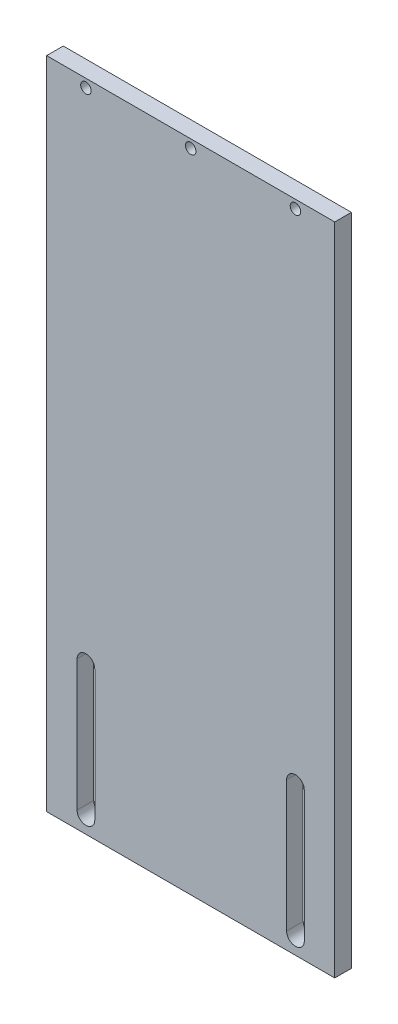
ISO-10303-21;
HEADER;
FILE_DESCRIPTION(('STEP AP214'),'2;1');
FILE_NAME('part.step','',(''),(''),'','','');
FILE_SCHEMA(('AUTOMOTIVE_DESIGN { 1 0 10303 214 1 1 1 1 }'));
ENDSEC;
DATA;
#1=APPLICATION_CONTEXT('core data for automotive mechanical design processes');
#2=APPLICATION_PROTOCOL_DEFINITION('international standard','automotive_design',2000,#1);
#3=PRODUCT_CONTEXT('',#1,'mechanical');
#4=PRODUCT('Part','Part','',(#3));
#5=PRODUCT_RELATED_PRODUCT_CATEGORY('part','',(#4));
#6=PRODUCT_DEFINITION_FORMATION('','',#4);
#7=PRODUCT_DEFINITION_CONTEXT('part definition',#1,'design');
#8=PRODUCT_DEFINITION('design','',#6,#7);
#9=PRODUCT_DEFINITION_SHAPE('','',#8);
#10=(LENGTH_UNIT() NAMED_UNIT(*) SI_UNIT(.MILLI.,.METRE.));
#11=(NAMED_UNIT(*) PLANE_ANGLE_UNIT() SI_UNIT($,.RADIAN.));
#12=(NAMED_UNIT(*) SI_UNIT($,.STERADIAN.) SOLID_ANGLE_UNIT());
#13=UNCERTAINTY_MEASURE_WITH_UNIT(LENGTH_MEASURE(1.E-05),#10,'distance_accuracy_value','');
#14=(GEOMETRIC_REPRESENTATION_CONTEXT(3) GLOBAL_UNCERTAINTY_ASSIGNED_CONTEXT((#13)) GLOBAL_UNIT_ASSIGNED_CONTEXT((#10,
#11,#12)) REPRESENTATION_CONTEXT('',''));
#15=CARTESIAN_POINT('',(0.,0.,0.));
#16=DIRECTION('',(0.,0.,1.));
#17=DIRECTION('',(1.,0.,0.));
#18=AXIS2_PLACEMENT_3D('',#15,#16,#17);
#19=CARTESIAN_POINT('',(0.,0.,6.35));
#20=DIRECTION('',(0.,0.,-1.));
#21=DIRECTION('',(-1.,0.,0.));
#22=AXIS2_PLACEMENT_3D('',#19,#20,#21);
#23=PLANE('',#22);
#24=CARTESIAN_POINT('',(0.,121.825,6.35));
#25=DIRECTION('',(0.,0.,1.));
#26=DIRECTION('',(1.,0.,0.));
#27=AXIS2_PLACEMENT_3D('',#24,#25,#26);
#28=CIRCLE('',#27,2.);
#29=CARTESIAN_POINT('',(2.,121.825,6.35));
#30=VERTEX_POINT('',#29);
#31=EDGE_CURVE('E158',#30,#30,#28,.T.);
#32=ORIENTED_EDGE('',*,*,#31,.F.);
#33=EDGE_LOOP('',(#32));
#34=FACE_BOUND('',#33,.T.);
#35=CARTESIAN_POINT('',(-40.,121.825,6.35));
#36=DIRECTION('',(0.,0.,1.));
#37=DIRECTION('',(1.,0.,0.));
#38=AXIS2_PLACEMENT_3D('',#35,#36,#37);
#39=CIRCLE('',#38,2.);
#40=CARTESIAN_POINT('',(-38.,121.825,6.35));
#41=VERTEX_POINT('',#40);
#42=EDGE_CURVE('E195',#41,#41,#39,.T.);
#43=ORIENTED_EDGE('',*,*,#42,.F.);
#44=EDGE_LOOP('',(#43));
#45=FACE_BOUND('',#44,.T.);
#46=DIRECTION('',(0.,1.,0.));
#47=VECTOR('',#46,1.);
#48=CARTESIAN_POINT('',(55.,-125.,6.35));
#49=LINE('',#48,#47);
#50=CARTESIAN_POINT('',(55.,-125.,6.35));
#51=VERTEX_POINT('',#50);
#52=CARTESIAN_POINT('',(55.,125.,6.35));
#53=VERTEX_POINT('',#52);
#54=EDGE_CURVE('E207',#51,#53,#49,.T.);
#55=ORIENTED_EDGE('',*,*,#54,.T.);
#56=DIRECTION('',(-1.,0.,0.));
#57=VECTOR('',#56,1.);
#58=CARTESIAN_POINT('',(-55.,125.,6.35));
#59=LINE('',#58,#57);
#60=CARTESIAN_POINT('',(-55.,125.,6.35));
#61=VERTEX_POINT('',#60);
#62=EDGE_CURVE('E210',#53,#61,#59,.T.);
#63=ORIENTED_EDGE('',*,*,#62,.T.);
#64=DIRECTION('',(0.,-1.,0.));
#65=VECTOR('',#64,1.);
#66=CARTESIAN_POINT('',(-55.,-125.,6.35));
#67=LINE('',#66,#65);
#68=CARTESIAN_POINT('',(-55.,-125.,6.35));
#69=VERTEX_POINT('',#68);
#70=EDGE_CURVE('E213',#61,#69,#67,.T.);
#71=ORIENTED_EDGE('',*,*,#70,.T.);
#72=DIRECTION('',(1.,0.,0.));
#73=VECTOR('',#72,1.);
#74=CARTESIAN_POINT('',(-55.,-125.,6.35));
#75=LINE('',#74,#73);
#76=EDGE_CURVE('E215',#69,#51,#75,.T.);
#77=ORIENTED_EDGE('',*,*,#76,.T.);
#78=EDGE_LOOP('',(#55,#63,#71,#77));
#79=FACE_BOUND('',#78,.T.);
#80=CARTESIAN_POINT('',(40.,121.825,6.35));
#81=DIRECTION('',(0.,0.,1.));
#82=DIRECTION('',(1.,0.,0.));
#83=AXIS2_PLACEMENT_3D('',#80,#81,#82);
#84=CIRCLE('',#83,2.);
#85=CARTESIAN_POINT('',(42.,121.825,6.35));
#86=VERTEX_POINT('',#85);
#87=EDGE_CURVE('E201',#86,#86,#84,.T.);
#88=ORIENTED_EDGE('',*,*,#87,.F.);
#89=EDGE_LOOP('',(#88));
#90=FACE_BOUND('',#89,.T.);
#91=CARTESIAN_POINT('',(40.,-68.65,6.35));
#92=DIRECTION('',(0.,0.,1.));
#93=DIRECTION('',(1.,0.,0.));
#94=AXIS2_PLACEMENT_3D('',#91,#92,#93);
#95=CIRCLE('',#94,3.375);
#96=CARTESIAN_POINT('',(43.375,-68.65,6.35));
#97=VERTEX_POINT('',#96);
#98=CARTESIAN_POINT('',(36.625,-68.65,6.35));
#99=VERTEX_POINT('',#98);
#100=EDGE_CURVE('E164',#97,#99,#95,.T.);
#101=ORIENTED_EDGE('',*,*,#100,.F.);
#102=DIRECTION('',(0.,1.,0.));
#103=VECTOR('',#102,1.);
#104=CARTESIAN_POINT('',(43.375,-68.65,6.35));
#105=LINE('',#104,#103);
#106=CARTESIAN_POINT('',(43.375,-118.65,6.35));
#107=VERTEX_POINT('',#106);
#108=EDGE_CURVE('E172',#107,#97,#105,.T.);
#109=ORIENTED_EDGE('',*,*,#108,.F.);
#110=CARTESIAN_POINT('',(40.,-118.65,6.35));
#111=DIRECTION('',(0.,0.,1.));
#112=DIRECTION('',(1.,0.,0.));
#113=AXIS2_PLACEMENT_3D('',#110,#111,#112);
#114=CIRCLE('',#113,3.375);
#115=CARTESIAN_POINT('',(36.625,-118.65,6.35));
#116=VERTEX_POINT('',#115);
#117=EDGE_CURVE('E169',#116,#107,#114,.T.);
#118=ORIENTED_EDGE('',*,*,#117,.F.);
#119=DIRECTION('',(0.,-1.,0.));
#120=VECTOR('',#119,1.);
#121=CARTESIAN_POINT('',(36.625,-68.65,6.35));
#122=LINE('',#121,#120);
#123=EDGE_CURVE('E166',#99,#116,#122,.T.);
#124=ORIENTED_EDGE('',*,*,#123,.F.);
#125=EDGE_LOOP('',(#101,#109,#118,#124));
#126=FACE_BOUND('',#125,.T.);
#127=CARTESIAN_POINT('',(-40.,-68.65,6.35));
#128=DIRECTION('',(0.,0.,1.));
#129=DIRECTION('',(1.,0.,0.));
#130=AXIS2_PLACEMENT_3D('',#127,#128,#129);
#131=CIRCLE('',#130,3.375);
#132=CARTESIAN_POINT('',(-36.625,-68.65,6.35));
#133=VERTEX_POINT('',#132);
#134=CARTESIAN_POINT('',(-43.375,-68.65,6.35));
#135=VERTEX_POINT('',#134);
#136=EDGE_CURVE('E122',#133,#135,#131,.T.);
#137=ORIENTED_EDGE('',*,*,#136,.F.);
#138=DIRECTION('',(0.,1.,0.));
#139=VECTOR('',#138,1.);
#140=CARTESIAN_POINT('',(-36.625,-68.65,6.35));
#141=LINE('',#140,#139);
#142=CARTESIAN_POINT('',(-36.625,-118.65,6.35));
#143=VERTEX_POINT('',#142);
#144=EDGE_CURVE('E144',#143,#133,#141,.T.);
#145=ORIENTED_EDGE('',*,*,#144,.F.);
#146=CARTESIAN_POINT('',(-40.,-118.65,6.35));
#147=DIRECTION('',(0.,0.,1.));
#148=DIRECTION('',(1.,0.,0.));
#149=AXIS2_PLACEMENT_3D('',#146,#147,#148);
#150=CIRCLE('',#149,3.375);
#151=CARTESIAN_POINT('',(-43.375,-118.65,6.35));
#152=VERTEX_POINT('',#151);
#153=EDGE_CURVE('E142',#152,#143,#150,.T.);
#154=ORIENTED_EDGE('',*,*,#153,.F.);
#155=DIRECTION('',(0.,-1.,0.));
#156=VECTOR('',#155,1.);
#157=CARTESIAN_POINT('',(-43.375,-68.65,6.35));
#158=LINE('',#157,#156);
#159=EDGE_CURVE('E130',#135,#152,#158,.T.);
#160=ORIENTED_EDGE('',*,*,#159,.F.);
#161=EDGE_LOOP('',(#137,#145,#154,#160));
#162=FACE_BOUND('',#161,.T.);
#163=ADVANCED_FACE('F33',(#34,#45,#79,#90,#126,#162),#23,.F.);
#164=CARTESIAN_POINT('',(0.,0.,0.));
#165=DIRECTION('',(0.,0.,-1.));
#166=DIRECTION('',(-1.,0.,0.));
#167=AXIS2_PLACEMENT_3D('',#164,#165,#166);
#168=PLANE('',#167);
#169=CARTESIAN_POINT('',(0.,121.825,0.));
#170=DIRECTION('',(0.,0.,1.));
#171=DIRECTION('',(1.,0.,0.));
#172=AXIS2_PLACEMENT_3D('',#169,#170,#171);
#173=CIRCLE('',#172,2.);
#174=CARTESIAN_POINT('',(2.,121.825,0.));
#175=VERTEX_POINT('',#174);
#176=EDGE_CURVE('E138',#175,#175,#173,.T.);
#177=ORIENTED_EDGE('',*,*,#176,.T.);
#178=EDGE_LOOP('',(#177));
#179=FACE_BOUND('',#178,.T.);
#180=CARTESIAN_POINT('',(-40.,121.825,0.));
#181=DIRECTION('',(0.,0.,1.));
#182=DIRECTION('',(1.,0.,0.));
#183=AXIS2_PLACEMENT_3D('',#180,#181,#182);
#184=CIRCLE('',#183,2.);
#185=CARTESIAN_POINT('',(-38.,121.825,0.));
#186=VERTEX_POINT('',#185);
#187=EDGE_CURVE('E194',#186,#186,#184,.T.);
#188=ORIENTED_EDGE('',*,*,#187,.T.);
#189=EDGE_LOOP('',(#188));
#190=FACE_BOUND('',#189,.T.);
#191=DIRECTION('',(0.,1.,0.));
#192=VECTOR('',#191,1.);
#193=CARTESIAN_POINT('',(55.,-125.,0.));
#194=LINE('',#193,#192);
#195=CARTESIAN_POINT('',(55.,-125.,0.));
#196=VERTEX_POINT('',#195);
#197=CARTESIAN_POINT('',(55.,125.,0.));
#198=VERTEX_POINT('',#197);
#199=EDGE_CURVE('E204',#196,#198,#194,.T.);
#200=ORIENTED_EDGE('',*,*,#199,.F.);
#201=DIRECTION('',(1.,0.,0.));
#202=VECTOR('',#201,1.);
#203=CARTESIAN_POINT('',(-55.,-125.,0.));
#204=LINE('',#203,#202);
#205=CARTESIAN_POINT('',(-55.,-125.,0.));
#206=VERTEX_POINT('',#205);
#207=EDGE_CURVE('E211',#206,#196,#204,.T.);
#208=ORIENTED_EDGE('',*,*,#207,.F.);
#209=DIRECTION('',(0.,-1.,0.));
#210=VECTOR('',#209,1.);
#211=CARTESIAN_POINT('',(-55.,-125.,0.));
#212=LINE('',#211,#210);
#213=CARTESIAN_POINT('',(-55.,125.,0.));
#214=VERTEX_POINT('',#213);
#215=EDGE_CURVE('E222',#214,#206,#212,.T.);
#216=ORIENTED_EDGE('',*,*,#215,.F.);
#217=DIRECTION('',(-1.,0.,0.));
#218=VECTOR('',#217,1.);
#219=CARTESIAN_POINT('',(-55.,125.,0.));
#220=LINE('',#219,#218);
#221=EDGE_CURVE('E220',#198,#214,#220,.T.);
#222=ORIENTED_EDGE('',*,*,#221,.F.);
#223=EDGE_LOOP('',(#200,#208,#216,#222));
#224=FACE_BOUND('',#223,.T.);
#225=CARTESIAN_POINT('',(40.,121.825,0.));
#226=DIRECTION('',(0.,0.,1.));
#227=DIRECTION('',(1.,0.,0.));
#228=AXIS2_PLACEMENT_3D('',#225,#226,#227);
#229=CIRCLE('',#228,2.);
#230=CARTESIAN_POINT('',(42.,121.825,0.));
#231=VERTEX_POINT('',#230);
#232=EDGE_CURVE('E198',#231,#231,#229,.T.);
#233=ORIENTED_EDGE('',*,*,#232,.T.);
#234=EDGE_LOOP('',(#233));
#235=FACE_BOUND('',#234,.T.);
#236=DIRECTION('',(0.,1.,0.));
#237=VECTOR('',#236,1.);
#238=CARTESIAN_POINT('',(43.375,-68.65,0.));
#239=LINE('',#238,#237);
#240=CARTESIAN_POINT('',(43.375,-118.65,0.));
#241=VERTEX_POINT('',#240);
#242=CARTESIAN_POINT('',(43.375,-68.65,0.));
#243=VERTEX_POINT('',#242);
#244=EDGE_CURVE('E167',#241,#243,#239,.T.);
#245=ORIENTED_EDGE('',*,*,#244,.T.);
#246=CARTESIAN_POINT('',(40.,-68.65,0.));
#247=DIRECTION('',(0.,0.,1.));
#248=DIRECTION('',(1.,0.,0.));
#249=AXIS2_PLACEMENT_3D('',#246,#247,#248);
#250=CIRCLE('',#249,3.375);
#251=CARTESIAN_POINT('',(36.625,-68.65,0.));
#252=VERTEX_POINT('',#251);
#253=EDGE_CURVE('E161',#243,#252,#250,.T.);
#254=ORIENTED_EDGE('',*,*,#253,.T.);
#255=DIRECTION('',(0.,-1.,0.));
#256=VECTOR('',#255,1.);
#257=CARTESIAN_POINT('',(36.625,-68.65,0.));
#258=LINE('',#257,#256);
#259=CARTESIAN_POINT('',(36.625,-118.65,0.));
#260=VERTEX_POINT('',#259);
#261=EDGE_CURVE('E177',#252,#260,#258,.T.);
#262=ORIENTED_EDGE('',*,*,#261,.T.);
#263=CARTESIAN_POINT('',(40.,-118.65,0.));
#264=DIRECTION('',(0.,0.,1.));
#265=DIRECTION('',(1.,0.,0.));
#266=AXIS2_PLACEMENT_3D('',#263,#264,#265);
#267=CIRCLE('',#266,3.375);
#268=EDGE_CURVE('E180',#260,#241,#267,.T.);
#269=ORIENTED_EDGE('',*,*,#268,.T.);
#270=EDGE_LOOP('',(#245,#254,#262,#269));
#271=FACE_BOUND('',#270,.T.);
#272=DIRECTION('',(0.,1.,0.));
#273=VECTOR('',#272,1.);
#274=CARTESIAN_POINT('',(-36.625,-68.65,0.));
#275=LINE('',#274,#273);
#276=CARTESIAN_POINT('',(-36.625,-118.65,0.));
#277=VERTEX_POINT('',#276);
#278=CARTESIAN_POINT('',(-36.625,-68.65,0.));
#279=VERTEX_POINT('',#278);
#280=EDGE_CURVE('E131',#277,#279,#275,.T.);
#281=ORIENTED_EDGE('',*,*,#280,.T.);
#282=CARTESIAN_POINT('',(-40.,-68.65,0.));
#283=DIRECTION('',(0.,0.,1.));
#284=DIRECTION('',(1.,0.,0.));
#285=AXIS2_PLACEMENT_3D('',#282,#283,#284);
#286=CIRCLE('',#285,3.375);
#287=CARTESIAN_POINT('',(-43.375,-68.65,0.));
#288=VERTEX_POINT('',#287);
#289=EDGE_CURVE('E56',#279,#288,#286,.T.);
#290=ORIENTED_EDGE('',*,*,#289,.T.);
#291=DIRECTION('',(0.,-1.,0.));
#292=VECTOR('',#291,1.);
#293=CARTESIAN_POINT('',(-43.375,-68.65,0.));
#294=LINE('',#293,#292);
#295=CARTESIAN_POINT('',(-43.375,-118.65,0.));
#296=VERTEX_POINT('',#295);
#297=EDGE_CURVE('E137',#288,#296,#294,.T.);
#298=ORIENTED_EDGE('',*,*,#297,.T.);
#299=CARTESIAN_POINT('',(-40.,-118.65,0.));
#300=DIRECTION('',(0.,0.,1.));
#301=DIRECTION('',(1.,0.,0.));
#302=AXIS2_PLACEMENT_3D('',#299,#300,#301);
#303=CIRCLE('',#302,3.375);
#304=EDGE_CURVE('E150',#296,#277,#303,.T.);
#305=ORIENTED_EDGE('',*,*,#304,.T.);
#306=EDGE_LOOP('',(#281,#290,#298,#305));
#307=FACE_BOUND('',#306,.T.);
#308=ADVANCED_FACE('F240',(#179,#190,#224,#235,#271,#307),#168,.T.);
#309=CARTESIAN_POINT('',(55.,-125.,6.35));
#310=DIRECTION('',(-1.,0.,0.));
#311=DIRECTION('',(0.,0.,1.));
#312=AXIS2_PLACEMENT_3D('',#309,#310,#311);
#313=PLANE('',#312);
#314=ORIENTED_EDGE('',*,*,#199,.T.);
#315=DIRECTION('',(0.,0.,-1.));
#316=VECTOR('',#315,1.);
#317=CARTESIAN_POINT('',(55.,125.,6.35));
#318=LINE('',#317,#316);
#319=EDGE_CURVE('E11',#53,#198,#318,.T.);
#320=ORIENTED_EDGE('',*,*,#319,.F.);
#321=ORIENTED_EDGE('',*,*,#54,.F.);
#322=DIRECTION('',(0.,0.,-1.));
#323=VECTOR('',#322,1.);
#324=CARTESIAN_POINT('',(55.,-125.,6.35));
#325=LINE('',#324,#323);
#326=EDGE_CURVE('E217',#51,#196,#325,.T.);
#327=ORIENTED_EDGE('',*,*,#326,.T.);
#328=EDGE_LOOP('',(#314,#320,#321,#327));
#329=FACE_BOUND('',#328,.T.);
#330=ADVANCED_FACE('F35',(#329),#313,.F.);
#331=CARTESIAN_POINT('',(-55.,125.,6.35));
#332=DIRECTION('',(0.,-1.,0.));
#333=DIRECTION('',(0.,0.,-1.));
#334=AXIS2_PLACEMENT_3D('',#331,#332,#333);
#335=PLANE('',#334);
#336=ORIENTED_EDGE('',*,*,#221,.T.);
#337=DIRECTION('',(0.,0.,-1.));
#338=VECTOR('',#337,1.);
#339=CARTESIAN_POINT('',(-55.,125.,6.35));
#340=LINE('',#339,#338);
#341=EDGE_CURVE('E41',#61,#214,#340,.T.);
#342=ORIENTED_EDGE('',*,*,#341,.F.);
#343=ORIENTED_EDGE('',*,*,#62,.F.);
#344=ORIENTED_EDGE('',*,*,#319,.T.);
#345=EDGE_LOOP('',(#336,#342,#343,#344));
#346=FACE_BOUND('',#345,.T.);
#347=ADVANCED_FACE('F251',(#346),#335,.F.);
#348=CARTESIAN_POINT('',(-55.,-125.,6.35));
#349=DIRECTION('',(1.,0.,0.));
#350=DIRECTION('',(0.,0.,-1.));
#351=AXIS2_PLACEMENT_3D('',#348,#349,#350);
#352=PLANE('',#351);
#353=ORIENTED_EDGE('',*,*,#215,.T.);
#354=DIRECTION('',(0.,0.,-1.));
#355=VECTOR('',#354,1.);
#356=CARTESIAN_POINT('',(-55.,-125.,6.35));
#357=LINE('',#356,#355);
#358=EDGE_CURVE('E227',#69,#206,#357,.T.);
#359=ORIENTED_EDGE('',*,*,#358,.F.);
#360=ORIENTED_EDGE('',*,*,#70,.F.);
#361=ORIENTED_EDGE('',*,*,#341,.T.);
#362=EDGE_LOOP('',(#353,#359,#360,#361));
#363=FACE_BOUND('',#362,.T.);
#364=ADVANCED_FACE('F234',(#363),#352,.F.);
#365=CARTESIAN_POINT('',(-55.,-125.,6.35));
#366=DIRECTION('',(0.,1.,0.));
#367=DIRECTION('',(0.,0.,1.));
#368=AXIS2_PLACEMENT_3D('',#365,#366,#367);
#369=PLANE('',#368);
#370=ORIENTED_EDGE('',*,*,#207,.T.);
#371=ORIENTED_EDGE('',*,*,#326,.F.);
#372=ORIENTED_EDGE('',*,*,#76,.F.);
#373=ORIENTED_EDGE('',*,*,#358,.T.);
#374=EDGE_LOOP('',(#370,#371,#372,#373));
#375=FACE_BOUND('',#374,.T.);
#376=ADVANCED_FACE('F244',(#375),#369,.F.);
#377=CARTESIAN_POINT('',(40.,121.825,6.35));
#378=DIRECTION('',(0.,0.,-1.));
#379=DIRECTION('',(-1.,0.,0.));
#380=AXIS2_PLACEMENT_3D('',#377,#378,#379);
#381=CYLINDRICAL_SURFACE('',#380,2.);
#382=ORIENTED_EDGE('',*,*,#87,.T.);
#383=EDGE_LOOP('',(#382));
#384=FACE_BOUND('',#383,.T.);
#385=ORIENTED_EDGE('',*,*,#232,.F.);
#386=EDGE_LOOP('',(#385));
#387=FACE_BOUND('',#386,.T.);
#388=ADVANCED_FACE('F269',(#384,#387),#381,.F.);
#389=CARTESIAN_POINT('',(-40.,121.825,6.35));
#390=DIRECTION('',(0.,0.,-1.));
#391=DIRECTION('',(-1.,0.,0.));
#392=AXIS2_PLACEMENT_3D('',#389,#390,#391);
#393=CYLINDRICAL_SURFACE('',#392,2.);
#394=ORIENTED_EDGE('',*,*,#42,.T.);
#395=EDGE_LOOP('',(#394));
#396=FACE_BOUND('',#395,.T.);
#397=ORIENTED_EDGE('',*,*,#187,.F.);
#398=EDGE_LOOP('',(#397));
#399=FACE_BOUND('',#398,.T.);
#400=ADVANCED_FACE('F276',(#396,#399),#393,.F.);
#401=CARTESIAN_POINT('',(40.,-68.65,6.35));
#402=DIRECTION('',(0.,0.,-1.));
#403=DIRECTION('',(-1.,0.,0.));
#404=AXIS2_PLACEMENT_3D('',#401,#402,#403);
#405=CYLINDRICAL_SURFACE('',#404,3.375);
#406=ORIENTED_EDGE('',*,*,#253,.F.);
#407=DIRECTION('',(0.,0.,-1.));
#408=VECTOR('',#407,1.);
#409=CARTESIAN_POINT('',(43.375,-68.65,6.35));
#410=LINE('',#409,#408);
#411=EDGE_CURVE('E174',#97,#243,#410,.T.);
#412=ORIENTED_EDGE('',*,*,#411,.F.);
#413=ORIENTED_EDGE('',*,*,#100,.T.);
#414=DIRECTION('',(0.,0.,-1.));
#415=VECTOR('',#414,1.);
#416=CARTESIAN_POINT('',(36.625,-68.65,6.35));
#417=LINE('',#416,#415);
#418=EDGE_CURVE('E191',#99,#252,#417,.T.);
#419=ORIENTED_EDGE('',*,*,#418,.T.);
#420=EDGE_LOOP('',(#406,#412,#413,#419));
#421=FACE_BOUND('',#420,.T.);
#422=ADVANCED_FACE('F281',(#421),#405,.F.);
#423=CARTESIAN_POINT('',(36.625,-68.65,6.35));
#424=DIRECTION('',(1.,0.,0.));
#425=DIRECTION('',(0.,1.,0.));
#426=AXIS2_PLACEMENT_3D('',#423,#424,#425);
#427=PLANE('',#426);
#428=ORIENTED_EDGE('',*,*,#261,.F.);
#429=ORIENTED_EDGE('',*,*,#418,.F.);
#430=ORIENTED_EDGE('',*,*,#123,.T.);
#431=DIRECTION('',(0.,0.,-1.));
#432=VECTOR('',#431,1.);
#433=CARTESIAN_POINT('',(36.625,-118.65,6.35));
#434=LINE('',#433,#432);
#435=EDGE_CURVE('E189',#116,#260,#434,.T.);
#436=ORIENTED_EDGE('',*,*,#435,.T.);
#437=EDGE_LOOP('',(#428,#429,#430,#436));
#438=FACE_BOUND('',#437,.T.);
#439=ADVANCED_FACE('F315',(#438),#427,.T.);
#440=CARTESIAN_POINT('',(40.,-118.65,6.35));
#441=DIRECTION('',(0.,0.,-1.));
#442=DIRECTION('',(-1.,0.,0.));
#443=AXIS2_PLACEMENT_3D('',#440,#441,#442);
#444=CYLINDRICAL_SURFACE('',#443,3.375);
#445=ORIENTED_EDGE('',*,*,#268,.F.);
#446=ORIENTED_EDGE('',*,*,#435,.F.);
#447=ORIENTED_EDGE('',*,*,#117,.T.);
#448=DIRECTION('',(0.,0.,-1.));
#449=VECTOR('',#448,1.);
#450=CARTESIAN_POINT('',(43.375,-118.65,6.35));
#451=LINE('',#450,#449);
#452=EDGE_CURVE('E187',#107,#241,#451,.T.);
#453=ORIENTED_EDGE('',*,*,#452,.T.);
#454=EDGE_LOOP('',(#445,#446,#447,#453));
#455=FACE_BOUND('',#454,.T.);
#456=ADVANCED_FACE('F311',(#455),#444,.F.);
#457=CARTESIAN_POINT('',(43.375,-68.65,6.35));
#458=DIRECTION('',(-1.,0.,0.));
#459=DIRECTION('',(0.,-1.,0.));
#460=AXIS2_PLACEMENT_3D('',#457,#458,#459);
#461=PLANE('',#460);
#462=ORIENTED_EDGE('',*,*,#244,.F.);
#463=ORIENTED_EDGE('',*,*,#452,.F.);
#464=ORIENTED_EDGE('',*,*,#108,.T.);
#465=ORIENTED_EDGE('',*,*,#411,.T.);
#466=EDGE_LOOP('',(#462,#463,#464,#465));
#467=FACE_BOUND('',#466,.T.);
#468=ADVANCED_FACE('F307',(#467),#461,.T.);
#469=CARTESIAN_POINT('',(0.,121.825,6.35));
#470=DIRECTION('',(0.,0.,-1.));
#471=DIRECTION('',(-1.,0.,0.));
#472=AXIS2_PLACEMENT_3D('',#469,#470,#471);
#473=CYLINDRICAL_SURFACE('',#472,2.);
#474=ORIENTED_EDGE('',*,*,#31,.T.);
#475=EDGE_LOOP('',(#474));
#476=FACE_BOUND('',#475,.T.);
#477=ORIENTED_EDGE('',*,*,#176,.F.);
#478=EDGE_LOOP('',(#477));
#479=FACE_BOUND('',#478,.T.);
#480=ADVANCED_FACE('F304',(#476,#479),#473,.F.);
#481=CARTESIAN_POINT('',(-40.,-68.65,6.35));
#482=DIRECTION('',(0.,0.,-1.));
#483=DIRECTION('',(-1.,0.,0.));
#484=AXIS2_PLACEMENT_3D('',#481,#482,#483);
#485=CYLINDRICAL_SURFACE('',#484,3.375);
#486=ORIENTED_EDGE('',*,*,#289,.F.);
#487=DIRECTION('',(0.,0.,-1.));
#488=VECTOR('',#487,1.);
#489=CARTESIAN_POINT('',(-36.625,-68.65,6.35));
#490=LINE('',#489,#488);
#491=EDGE_CURVE('E126',#133,#279,#490,.T.);
#492=ORIENTED_EDGE('',*,*,#491,.F.);
#493=ORIENTED_EDGE('',*,*,#136,.T.);
#494=DIRECTION('',(0.,0.,-1.));
#495=VECTOR('',#494,1.);
#496=CARTESIAN_POINT('',(-43.375,-68.65,6.35));
#497=LINE('',#496,#495);
#498=EDGE_CURVE('E125',#135,#288,#497,.T.);
#499=ORIENTED_EDGE('',*,*,#498,.T.);
#500=EDGE_LOOP('',(#486,#492,#493,#499));
#501=FACE_BOUND('',#500,.T.);
#502=ADVANCED_FACE('F124',(#501),#485,.F.);
#503=CARTESIAN_POINT('',(-43.375,-68.65,6.35));
#504=DIRECTION('',(1.,0.,0.));
#505=DIRECTION('',(0.,0.,-1.));
#506=AXIS2_PLACEMENT_3D('',#503,#504,#505);
#507=PLANE('',#506);
#508=ORIENTED_EDGE('',*,*,#297,.F.);
#509=ORIENTED_EDGE('',*,*,#498,.F.);
#510=ORIENTED_EDGE('',*,*,#159,.T.);
#511=DIRECTION('',(0.,0.,-1.));
#512=VECTOR('',#511,1.);
#513=CARTESIAN_POINT('',(-43.375,-118.65,6.35));
#514=LINE('',#513,#512);
#515=EDGE_CURVE('E139',#152,#296,#514,.T.);
#516=ORIENTED_EDGE('',*,*,#515,.T.);
#517=EDGE_LOOP('',(#508,#509,#510,#516));
#518=FACE_BOUND('',#517,.T.);
#519=ADVANCED_FACE('F134',(#518),#507,.T.);
#520=CARTESIAN_POINT('',(-40.,-118.65,6.35));
#521=DIRECTION('',(0.,0.,-1.));
#522=DIRECTION('',(-1.,0.,0.));
#523=AXIS2_PLACEMENT_3D('',#520,#521,#522);
#524=CYLINDRICAL_SURFACE('',#523,3.375);
#525=ORIENTED_EDGE('',*,*,#304,.F.);
#526=ORIENTED_EDGE('',*,*,#515,.F.);
#527=ORIENTED_EDGE('',*,*,#153,.T.);
#528=DIRECTION('',(0.,0.,-1.));
#529=VECTOR('',#528,1.);
#530=CARTESIAN_POINT('',(-36.625,-118.65,6.35));
#531=LINE('',#530,#529);
#532=EDGE_CURVE('E48',#143,#277,#531,.T.);
#533=ORIENTED_EDGE('',*,*,#532,.T.);
#534=EDGE_LOOP('',(#525,#526,#527,#533));
#535=FACE_BOUND('',#534,.T.);
#536=ADVANCED_FACE('F292',(#535),#524,.F.);
#537=CARTESIAN_POINT('',(-36.625,-68.65,6.35));
#538=DIRECTION('',(-1.,0.,0.));
#539=DIRECTION('',(0.,0.,1.));
#540=AXIS2_PLACEMENT_3D('',#537,#538,#539);
#541=PLANE('',#540);
#542=ORIENTED_EDGE('',*,*,#280,.F.);
#543=ORIENTED_EDGE('',*,*,#532,.F.);
#544=ORIENTED_EDGE('',*,*,#144,.T.);
#545=ORIENTED_EDGE('',*,*,#491,.T.);
#546=EDGE_LOOP('',(#542,#543,#544,#545));
#547=FACE_BOUND('',#546,.T.);
#548=ADVANCED_FACE('F290',(#547),#541,.T.);
#549=CLOSED_SHELL('',(#163,#308,#330,#347,#364,#376,#388,#400,#422,#439,#456,#468,#480,#502,
#519,#536,#548));
#550=MANIFOLD_SOLID_BREP('B2',#549);
#551=ADVANCED_BREP_SHAPE_REPRESENTATION('',(#18,#550),#14);
#552=SHAPE_DEFINITION_REPRESENTATION(#9,#551);
ENDSEC;
END-ISO-10303-21;
